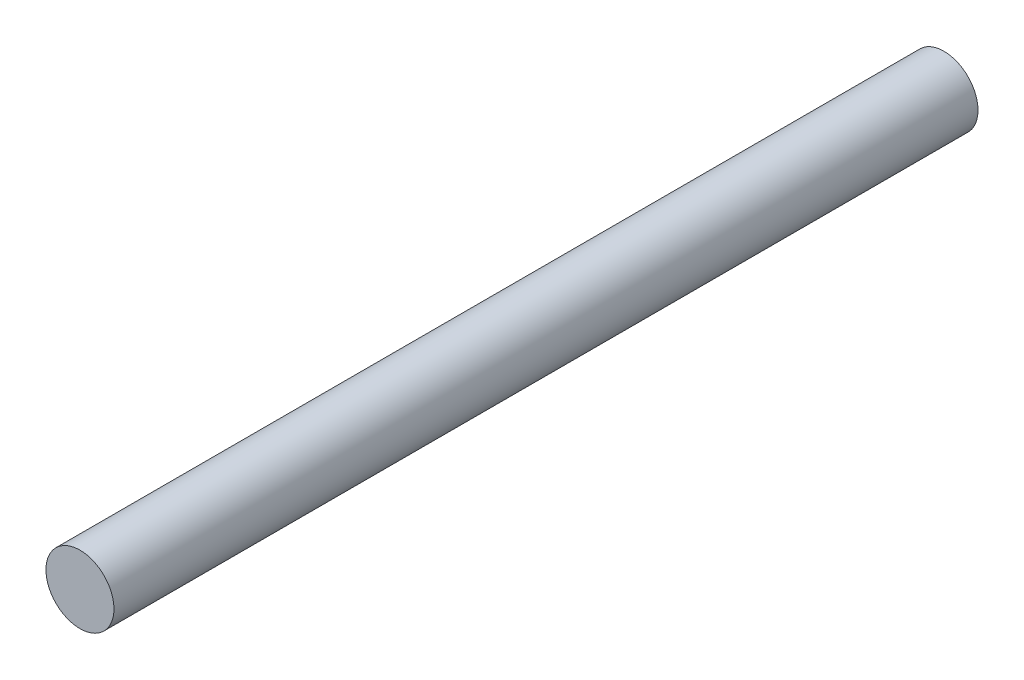
ISO-10303-21;
HEADER;
FILE_DESCRIPTION(('STEP AP214'),'2;1');
FILE_NAME('part.step','',(''),(''),'','','');
FILE_SCHEMA(('AUTOMOTIVE_DESIGN { 1 0 10303 214 1 1 1 1 }'));
ENDSEC;
DATA;
#1=APPLICATION_CONTEXT('core data for automotive mechanical design processes');
#2=APPLICATION_PROTOCOL_DEFINITION('international standard','automotive_design',2000,#1);
#3=PRODUCT_CONTEXT('',#1,'mechanical');
#4=PRODUCT('Part','Part','',(#3));
#5=PRODUCT_RELATED_PRODUCT_CATEGORY('part','',(#4));
#6=PRODUCT_DEFINITION_FORMATION('','',#4);
#7=PRODUCT_DEFINITION_CONTEXT('part definition',#1,'design');
#8=PRODUCT_DEFINITION('design','',#6,#7);
#9=PRODUCT_DEFINITION_SHAPE('','',#8);
#10=(LENGTH_UNIT() NAMED_UNIT(*) SI_UNIT(.MILLI.,.METRE.));
#11=(NAMED_UNIT(*) PLANE_ANGLE_UNIT() SI_UNIT($,.RADIAN.));
#12=(NAMED_UNIT(*) SI_UNIT($,.STERADIAN.) SOLID_ANGLE_UNIT());
#13=UNCERTAINTY_MEASURE_WITH_UNIT(LENGTH_MEASURE(1.E-05),#10,'distance_accuracy_value','');
#14=(GEOMETRIC_REPRESENTATION_CONTEXT(3) GLOBAL_UNCERTAINTY_ASSIGNED_CONTEXT((#13)) GLOBAL_UNIT_ASSIGNED_CONTEXT((#10,
#11,#12)) REPRESENTATION_CONTEXT('',''));
#15=CARTESIAN_POINT('',(0.,0.,0.));
#16=DIRECTION('',(0.,0.,1.));
#17=DIRECTION('',(1.,0.,0.));
#18=AXIS2_PLACEMENT_3D('',#15,#16,#17);
#19=CARTESIAN_POINT('',(0.,0.,76.2));
#20=DIRECTION('',(0.,0.,-1.));
#21=DIRECTION('',(-1.,0.,0.));
#22=AXIS2_PLACEMENT_3D('',#19,#20,#21);
#23=CYLINDRICAL_SURFACE('',#22,3.);
#24=CARTESIAN_POINT('',(0.,0.,76.2));
#25=DIRECTION('',(0.,0.,1.));
#26=DIRECTION('',(1.,0.,0.));
#27=AXIS2_PLACEMENT_3D('',#24,#25,#26);
#28=CIRCLE('',#27,3.);
#29=CARTESIAN_POINT('',(3.,0.,76.2));
#30=VERTEX_POINT('',#29);
#31=EDGE_CURVE('E10',#30,#30,#28,.T.);
#32=ORIENTED_EDGE('',*,*,#31,.F.);
#33=EDGE_LOOP('',(#32));
#34=FACE_BOUND('',#33,.T.);
#35=CARTESIAN_POINT('',(0.,0.,0.));
#36=DIRECTION('',(0.,0.,1.));
#37=DIRECTION('',(1.,0.,0.));
#38=AXIS2_PLACEMENT_3D('',#35,#36,#37);
#39=CIRCLE('',#38,3.);
#40=CARTESIAN_POINT('',(3.,0.,0.));
#41=VERTEX_POINT('',#40);
#42=EDGE_CURVE('E33',#41,#41,#39,.T.);
#43=ORIENTED_EDGE('',*,*,#42,.T.);
#44=EDGE_LOOP('',(#43));
#45=FACE_BOUND('',#44,.T.);
#46=ADVANCED_FACE('F30',(#34,#45),#23,.T.);
#47=CARTESIAN_POINT('',(0.,0.,76.2));
#48=DIRECTION('',(0.,0.,1.));
#49=DIRECTION('',(1.,0.,0.));
#50=AXIS2_PLACEMENT_3D('',#47,#48,#49);
#51=PLANE('',#50);
#52=ORIENTED_EDGE('',*,*,#31,.T.);
#53=EDGE_LOOP('',(#52));
#54=FACE_BOUND('',#53,.T.);
#55=ADVANCED_FACE('F45',(#54),#51,.T.);
#56=CARTESIAN_POINT('',(0.,0.,0.));
#57=DIRECTION('',(0.,0.,1.));
#58=DIRECTION('',(1.,0.,0.));
#59=AXIS2_PLACEMENT_3D('',#56,#57,#58);
#60=PLANE('',#59);
#61=ORIENTED_EDGE('',*,*,#42,.F.);
#62=EDGE_LOOP('',(#61));
#63=FACE_BOUND('',#62,.T.);
#64=ADVANCED_FACE('F43',(#63),#60,.F.);
#65=CLOSED_SHELL('',(#46,#55,#64));
#66=MANIFOLD_SOLID_BREP('B2',#65);
#67=ADVANCED_BREP_SHAPE_REPRESENTATION('',(#18,#66),#14);
#68=SHAPE_DEFINITION_REPRESENTATION(#9,#67);
ENDSEC;
END-ISO-10303-21;
